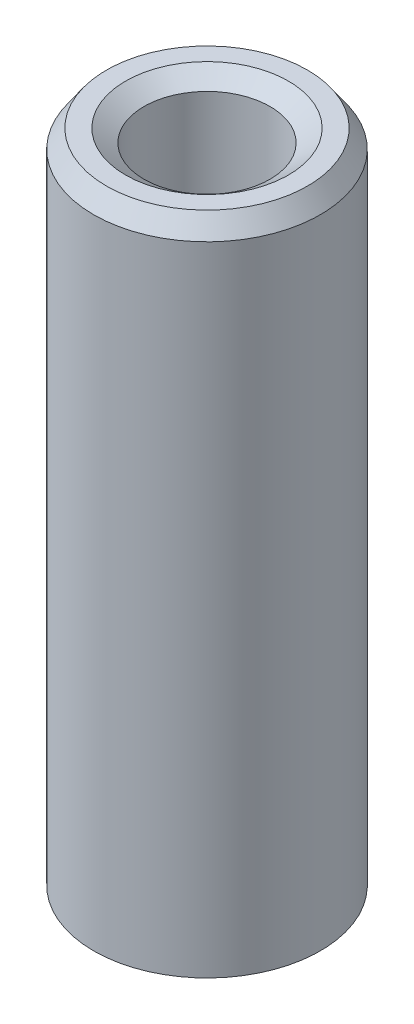
ISO-10303-21;
HEADER;
FILE_DESCRIPTION(('STEP AP214'),'2;1');
FILE_NAME('part.step','',(''),(''),'','','');
FILE_SCHEMA(('AUTOMOTIVE_DESIGN { 1 0 10303 214 1 1 1 1 }'));
ENDSEC;
DATA;
#1=APPLICATION_CONTEXT('core data for automotive mechanical design processes');
#2=APPLICATION_PROTOCOL_DEFINITION('international standard','automotive_design',2000,#1);
#3=PRODUCT_CONTEXT('',#1,'mechanical');
#4=PRODUCT('Part','Part','',(#3));
#5=PRODUCT_RELATED_PRODUCT_CATEGORY('part','',(#4));
#6=PRODUCT_DEFINITION_FORMATION('','',#4);
#7=PRODUCT_DEFINITION_CONTEXT('part definition',#1,'design');
#8=PRODUCT_DEFINITION('design','',#6,#7);
#9=PRODUCT_DEFINITION_SHAPE('','',#8);
#10=(LENGTH_UNIT() NAMED_UNIT(*) SI_UNIT(.MILLI.,.METRE.));
#11=(NAMED_UNIT(*) PLANE_ANGLE_UNIT() SI_UNIT($,.RADIAN.));
#12=(NAMED_UNIT(*) SI_UNIT($,.STERADIAN.) SOLID_ANGLE_UNIT());
#13=UNCERTAINTY_MEASURE_WITH_UNIT(LENGTH_MEASURE(1.E-05),#10,'distance_accuracy_value','');
#14=(GEOMETRIC_REPRESENTATION_CONTEXT(3) GLOBAL_UNCERTAINTY_ASSIGNED_CONTEXT((#13)) GLOBAL_UNIT_ASSIGNED_CONTEXT((#10,
#11,#12)) REPRESENTATION_CONTEXT('',''));
#15=CARTESIAN_POINT('',(0.,0.,0.));
#16=DIRECTION('',(0.,0.,1.));
#17=DIRECTION('',(1.,0.,0.));
#18=AXIS2_PLACEMENT_3D('',#15,#16,#17);
#19=CARTESIAN_POINT('',(0.,132.7397673572,0.));
#20=DIRECTION('',(0.,-1.,0.));
#21=DIRECTION('',(0.,0.,-1.));
#22=AXIS2_PLACEMENT_3D('',#19,#20,#21);
#23=CYLINDRICAL_SURFACE('',#22,22.5);
#24=CARTESIAN_POINT('',(0.,2.54550053230707,0.));
#25=DIRECTION('',(0.,1.,0.));
#26=DIRECTION('',(0.,0.,1.));
#27=AXIS2_PLACEMENT_3D('',#24,#25,#26);
#28=CIRCLE('',#27,22.5);
#29=CARTESIAN_POINT('',(0.,2.54550053230707,22.5));
#30=VERTEX_POINT('',#29);
#31=EDGE_CURVE('E10',#30,#30,#28,.T.);
#32=ORIENTED_EDGE('',*,*,#31,.T.);
#33=EDGE_LOOP('',(#32));
#34=FACE_BOUND('',#33,.T.);
#35=CARTESIAN_POINT('',(0.,129.090302973506,0.));
#36=DIRECTION('',(0.,1.,0.));
#37=DIRECTION('',(0.,0.,1.));
#38=AXIS2_PLACEMENT_3D('',#35,#36,#37);
#39=CIRCLE('',#38,22.5);
#40=CARTESIAN_POINT('',(0.,129.090302973506,22.5));
#41=VERTEX_POINT('',#40);
#42=EDGE_CURVE('E50',#41,#41,#39,.F.);
#43=ORIENTED_EDGE('',*,*,#42,.T.);
#44=EDGE_LOOP('',(#43));
#45=FACE_BOUND('',#44,.T.);
#46=ADVANCED_FACE('F39',(#34,#45),#23,.T.);
#47=CARTESIAN_POINT('',(0.,132.7397673572,0.));
#48=DIRECTION('',(0.,1.,0.));
#49=DIRECTION('',(0.,0.,1.));
#50=AXIS2_PLACEMENT_3D('',#47,#48,#49);
#51=PLANE('',#50);
#52=CARTESIAN_POINT('',(0.,132.7397673572,0.));
#53=DIRECTION('',(0.,1.,0.));
#54=DIRECTION('',(0.,0.,1.));
#55=AXIS2_PLACEMENT_3D('',#52,#53,#54);
#56=CIRCLE('',#55,16.1635621613427);
#57=CARTESIAN_POINT('',(0.,132.7397673572,16.1635621613427));
#58=VERTEX_POINT('',#57);
#59=EDGE_CURVE('E58',#58,#58,#56,.F.);
#60=ORIENTED_EDGE('',*,*,#59,.T.);
#61=EDGE_LOOP('',(#60));
#62=FACE_BOUND('',#61,.T.);
#63=CARTESIAN_POINT('',(0.,132.7397673572,0.));
#64=DIRECTION('',(0.,1.,0.));
#65=DIRECTION('',(0.,0.,1.));
#66=AXIS2_PLACEMENT_3D('',#63,#64,#65);
#67=CIRCLE('',#66,19.9544994676929);
#68=CARTESIAN_POINT('',(0.,132.7397673572,19.9544994676929));
#69=VERTEX_POINT('',#68);
#70=EDGE_CURVE('E61',#69,#69,#67,.T.);
#71=ORIENTED_EDGE('',*,*,#70,.T.);
#72=EDGE_LOOP('',(#71));
#73=FACE_BOUND('',#72,.T.);
#74=ADVANCED_FACE('F88',(#62,#73),#51,.T.);
#75=CARTESIAN_POINT('',(0.,0.,0.));
#76=DIRECTION('',(0.,1.,0.));
#77=DIRECTION('',(0.,0.,1.));
#78=AXIS2_PLACEMENT_3D('',#75,#76,#77);
#79=PLANE('',#78);
#80=CARTESIAN_POINT('',(0.,0.,0.));
#81=DIRECTION('',(0.,1.,0.));
#82=DIRECTION('',(0.,0.,1.));
#83=AXIS2_PLACEMENT_3D('',#80,#81,#82);
#84=CIRCLE('',#83,15.0595983099555);
#85=CARTESIAN_POINT('',(0.,0.,15.0595983099555));
#86=VERTEX_POINT('',#85);
#87=EDGE_CURVE('E51',#86,#86,#84,.T.);
#88=ORIENTED_EDGE('',*,*,#87,.T.);
#89=EDGE_LOOP('',(#88));
#90=FACE_BOUND('',#89,.T.);
#91=CARTESIAN_POINT('',(0.,0.,0.));
#92=DIRECTION('',(0.,1.,0.));
#93=DIRECTION('',(0.,0.,1.));
#94=AXIS2_PLACEMENT_3D('',#91,#92,#93);
#95=CIRCLE('',#94,18.8505356163057);
#96=CARTESIAN_POINT('',(0.,0.,18.8505356163057));
#97=VERTEX_POINT('',#96);
#98=EDGE_CURVE('E54',#97,#97,#95,.F.);
#99=ORIENTED_EDGE('',*,*,#98,.T.);
#100=EDGE_LOOP('',(#99));
#101=FACE_BOUND('',#100,.T.);
#102=ADVANCED_FACE('F83',(#90,#101),#79,.F.);
#103=CARTESIAN_POINT('',(0.,132.7397673572,0.));
#104=DIRECTION('',(0.,-1.,0.));
#105=DIRECTION('',(0.,0.,-1.));
#106=AXIS2_PLACEMENT_3D('',#103,#104,#105);
#107=CYLINDRICAL_SURFACE('',#106,12.5140977776484);
#108=CARTESIAN_POINT('',(0.,130.194266824893,0.));
#109=DIRECTION('',(0.,1.,0.));
#110=DIRECTION('',(0.,0.,1.));
#111=AXIS2_PLACEMENT_3D('',#108,#109,#110);
#112=CIRCLE('',#111,12.5140977776484);
#113=CARTESIAN_POINT('',(0.,130.194266824893,12.5140977776484));
#114=VERTEX_POINT('',#113);
#115=EDGE_CURVE('E67',#114,#114,#112,.T.);
#116=ORIENTED_EDGE('',*,*,#115,.T.);
#117=EDGE_LOOP('',(#116));
#118=FACE_BOUND('',#117,.T.);
#119=CARTESIAN_POINT('',(0.,3.64946438369429,0.));
#120=DIRECTION('',(0.,1.,0.));
#121=DIRECTION('',(0.,0.,1.));
#122=AXIS2_PLACEMENT_3D('',#119,#120,#121);
#123=CIRCLE('',#122,12.5140977776484);
#124=CARTESIAN_POINT('',(0.,3.64946438369429,12.5140977776484));
#125=VERTEX_POINT('',#124);
#126=EDGE_CURVE('E69',#125,#125,#123,.F.);
#127=ORIENTED_EDGE('',*,*,#126,.T.);
#128=EDGE_LOOP('',(#127));
#129=FACE_BOUND('',#128,.T.);
#130=ADVANCED_FACE('F71',(#118,#129),#107,.F.);
#131=CARTESIAN_POINT('',(0.,130.194266824893,0.));
#132=DIRECTION('',(0.,1.,0.));
#133=DIRECTION('',(0.,0.,1.));
#134=AXIS2_PLACEMENT_3D('',#131,#132,#133);
#135=CONICAL_SURFACE('',#134,12.5140977776484,0.961750347474516);
#136=ORIENTED_EDGE('',*,*,#59,.F.);
#137=EDGE_LOOP('',(#136));
#138=FACE_BOUND('',#137,.T.);
#139=ORIENTED_EDGE('',*,*,#115,.F.);
#140=EDGE_LOOP('',(#139));
#141=FACE_BOUND('',#140,.T.);
#142=ADVANCED_FACE('F77',(#138,#141),#135,.F.);
#143=CARTESIAN_POINT('',(0.,0.,0.));
#144=DIRECTION('',(0.,-1.,0.));
#145=DIRECTION('',(0.,0.,-1.));
#146=AXIS2_PLACEMENT_3D('',#143,#144,#145);
#147=CONICAL_SURFACE('',#146,15.0595983099555,0.609045979320378);
#148=ORIENTED_EDGE('',*,*,#126,.F.);
#149=EDGE_LOOP('',(#148));
#150=FACE_BOUND('',#149,.T.);
#151=ORIENTED_EDGE('',*,*,#87,.F.);
#152=EDGE_LOOP('',(#151));
#153=FACE_BOUND('',#152,.T.);
#154=ADVANCED_FACE('F73',(#150,#153),#147,.F.);
#155=CARTESIAN_POINT('',(0.,2.54550053230707,0.));
#156=DIRECTION('',(0.,1.,0.));
#157=DIRECTION('',(0.,0.,1.));
#158=AXIS2_PLACEMENT_3D('',#155,#156,#157);
#159=CONICAL_SURFACE('',#158,22.5,0.961750347474519);
#160=ORIENTED_EDGE('',*,*,#98,.F.);
#161=EDGE_LOOP('',(#160));
#162=FACE_BOUND('',#161,.T.);
#163=ORIENTED_EDGE('',*,*,#31,.F.);
#164=EDGE_LOOP('',(#163));
#165=FACE_BOUND('',#164,.T.);
#166=ADVANCED_FACE('F76',(#162,#165),#159,.T.);
#167=CARTESIAN_POINT('',(0.,132.7397673572,0.));
#168=DIRECTION('',(0.,-1.,0.));
#169=DIRECTION('',(0.,0.,-1.));
#170=AXIS2_PLACEMENT_3D('',#167,#168,#169);
#171=CONICAL_SURFACE('',#170,19.9544994676929,0.609045979320382);
#172=ORIENTED_EDGE('',*,*,#42,.F.);
#173=EDGE_LOOP('',(#172));
#174=FACE_BOUND('',#173,.T.);
#175=ORIENTED_EDGE('',*,*,#70,.F.);
#176=EDGE_LOOP('',(#175));
#177=FACE_BOUND('',#176,.T.);
#178=ADVANCED_FACE('F45',(#174,#177),#171,.T.);
#179=CLOSED_SHELL('',(#46,#74,#102,#130,#142,#154,#166,#178));
#180=MANIFOLD_SOLID_BREP('B2',#179);
#181=ADVANCED_BREP_SHAPE_REPRESENTATION('',(#18,#180),#14);
#182=SHAPE_DEFINITION_REPRESENTATION(#9,#181);
ENDSEC;
END-ISO-10303-21;
